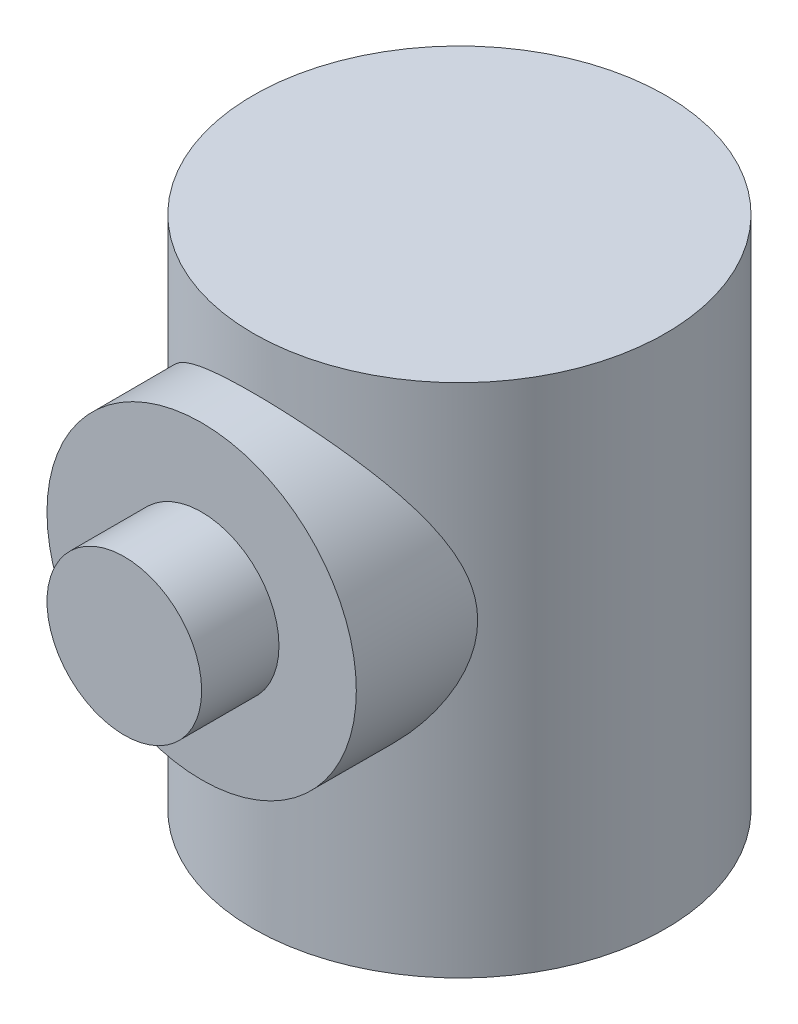
ISO-10303-21;
HEADER;
FILE_DESCRIPTION(('STEP AP214'),'2;1');
FILE_NAME('part.step','',(''),(''),'','','');
FILE_SCHEMA(('AUTOMOTIVE_DESIGN { 1 0 10303 214 1 1 1 1 }'));
ENDSEC;
DATA;
#1=APPLICATION_CONTEXT('core data for automotive mechanical design processes');
#2=APPLICATION_PROTOCOL_DEFINITION('international standard','automotive_design',2000,#1);
#3=PRODUCT_CONTEXT('',#1,'mechanical');
#4=PRODUCT('Part','Part','',(#3));
#5=PRODUCT_RELATED_PRODUCT_CATEGORY('part','',(#4));
#6=PRODUCT_DEFINITION_FORMATION('','',#4);
#7=PRODUCT_DEFINITION_CONTEXT('part definition',#1,'design');
#8=PRODUCT_DEFINITION('design','',#6,#7);
#9=PRODUCT_DEFINITION_SHAPE('','',#8);
#10=(LENGTH_UNIT() NAMED_UNIT(*) SI_UNIT(.MILLI.,.METRE.));
#11=(NAMED_UNIT(*) PLANE_ANGLE_UNIT() SI_UNIT($,.RADIAN.));
#12=(NAMED_UNIT(*) SI_UNIT($,.STERADIAN.) SOLID_ANGLE_UNIT());
#13=UNCERTAINTY_MEASURE_WITH_UNIT(LENGTH_MEASURE(1.E-05),#10,'distance_accuracy_value','');
#14=(GEOMETRIC_REPRESENTATION_CONTEXT(3) GLOBAL_UNCERTAINTY_ASSIGNED_CONTEXT((#13)) GLOBAL_UNIT_ASSIGNED_CONTEXT((#10,
#11,#12)) REPRESENTATION_CONTEXT('',''));
#15=CARTESIAN_POINT('',(0.,0.,0.));
#16=DIRECTION('',(0.,0.,1.));
#17=DIRECTION('',(1.,0.,0.));
#18=AXIS2_PLACEMENT_3D('',#15,#16,#17);
#19=CARTESIAN_POINT('',(0.,100.,0.));
#20=DIRECTION('',(0.,-1.,0.));
#21=DIRECTION('',(0.,0.,-1.));
#22=AXIS2_PLACEMENT_3D('',#19,#20,#21);
#23=CYLINDRICAL_SURFACE('',#22,40.);
#24=CARTESIAN_POINT('',(0.,100.,0.));
#25=DIRECTION('',(0.,1.,0.));
#26=DIRECTION('',(0.,0.,1.));
#27=AXIS2_PLACEMENT_3D('',#24,#25,#26);
#28=CIRCLE('',#27,40.);
#29=CARTESIAN_POINT('',(0.,100.,40.));
#30=VERTEX_POINT('',#29);
#31=EDGE_CURVE('E48',#30,#30,#28,.T.);
#32=ORIENTED_EDGE('',*,*,#31,.F.);
#33=EDGE_LOOP('',(#32));
#34=FACE_BOUND('',#33,.T.);
#35=CARTESIAN_POINT('',(0.,0.,0.));
#36=DIRECTION('',(0.,1.,0.));
#37=DIRECTION('',(0.,0.,1.));
#38=AXIS2_PLACEMENT_3D('',#35,#36,#37);
#39=CIRCLE('',#38,40.);
#40=CARTESIAN_POINT('',(0.,0.,40.));
#41=VERTEX_POINT('',#40);
#42=EDGE_CURVE('E61',#41,#41,#39,.T.);
#43=ORIENTED_EDGE('',*,*,#42,.T.);
#44=EDGE_LOOP('',(#43));
#45=FACE_BOUND('',#44,.T.);
#46=CARTESIAN_POINT('',(-30.,60.,26.4575131106459));
#47=CARTESIAN_POINT('',(-29.9999901359375,59.2998405138202,26.4575335088093));
#48=CARTESIAN_POINT('',(-29.975417377863,58.5995280577432,26.4854681873827));
#49=CARTESIAN_POINT('',(-29.877825638989,57.2065119199111,26.5955010971802));
#50=CARTESIAN_POINT('',(-29.8047904945962,56.5138108551583,26.6776173994755));
#51=CARTESIAN_POINT('',(-29.6120437956416,55.1411423293315,26.8914016541717));
#52=CARTESIAN_POINT('',(-29.4922219658747,54.4612089592852,27.0231866488994));
#53=CARTESIAN_POINT('',(-29.2085575718821,53.1203176334944,27.3295362041768));
#54=CARTESIAN_POINT('',(-29.04470224758,52.4593652396271,27.5041131637402));
#55=CARTESIAN_POINT('',(-28.7694227892252,51.4893430094092,27.7909610693061));
#56=CARTESIAN_POINT('',(-28.6735289054215,51.1717491195116,27.8899523672857));
#57=CARTESIAN_POINT('',(-28.4721003569898,50.5422711079854,28.0955551878497));
#58=CARTESIAN_POINT('',(-28.3665692816998,50.2303849120799,28.2021638701736));
#59=CARTESIAN_POINT('',(-28.0359007783745,49.3033248797493,28.5321777747143));
#60=CARTESIAN_POINT('',(-27.7966825802248,48.6967303508022,28.7657766453663));
#61=CARTESIAN_POINT('',(-27.2829694032794,47.5076411150634,29.2534610037519));
#62=CARTESIAN_POINT('',(-27.0084863018999,46.9251383809443,29.5075395831179));
#63=CARTESIAN_POINT('',(-26.4257606427246,45.7841809118825,30.0305260008613));
#64=CARTESIAN_POINT('',(-26.1175156360258,45.2257279254747,30.2994349142463));
#65=CARTESIAN_POINT('',(-25.4004799604089,44.0185589962804,30.9043557947668));
#66=CARTESIAN_POINT('',(-24.984153533674,43.3754416358282,31.242623996645));
#67=CARTESIAN_POINT('',(-24.1054102408405,42.1250695499427,31.9255224737044));
#68=CARTESIAN_POINT('',(-23.6429895833368,41.5178177811276,32.2701532703276));
#69=CARTESIAN_POINT('',(-22.6724021513159,40.3392341229466,32.9593223459287));
#70=CARTESIAN_POINT('',(-22.1641720478893,39.767953873029,33.3038598153625));
#71=CARTESIAN_POINT('',(-21.1032813402667,38.6636990669604,33.9860166693511));
#72=CARTESIAN_POINT('',(-20.5506170505432,38.1307276952406,34.3236354771273));
#73=CARTESIAN_POINT('',(-19.284053361477,37.0003089245736,35.0537196682181));
#74=CARTESIAN_POINT('',(-18.5602959930798,36.4119700343085,35.4432792377973));
#75=CARTESIAN_POINT('',(-17.0508645429086,35.2988464453328,36.193619391001));
#76=CARTESIAN_POINT('',(-16.265176602401,34.7740760389156,36.5543934965024));
#77=CARTESIAN_POINT('',(-15.0437008514415,34.0401785522885,37.0659114128811));
#78=CARTESIAN_POINT('',(-14.6297248243183,33.8045855947033,37.2313592282778));
#79=CARTESIAN_POINT('',(-13.7877079840592,33.3517817463831,37.5513226746533));
#80=CARTESIAN_POINT('',(-13.3596680306474,33.1345697349173,37.705838972059));
#81=CARTESIAN_POINT('',(-12.4904452810925,32.7195934734038,38.0026258245914));
#82=CARTESIAN_POINT('',(-12.0492701693727,32.5218181327485,38.1449033573359));
#83=CARTESIAN_POINT('',(-11.154274459431,32.1464954960194,38.4161540849943));
#84=CARTESIAN_POINT('',(-10.7004508798339,31.9689530200945,38.5451241089226));
#85=CARTESIAN_POINT('',(-9.59918752732703,31.5690059304673,38.8367859190684));
#86=CARTESIAN_POINT('',(-8.94622311190012,31.3566661906166,38.9926149778366));
#87=CARTESIAN_POINT('',(-7.62112152480346,30.9759852332847,39.273106074276));
#88=CARTESIAN_POINT('',(-6.94898896839565,30.807633522029,39.3977755450629));
#89=CARTESIAN_POINT('',(-5.92971733436566,30.5898109724029,39.5595361021982));
#90=CARTESIAN_POINT('',(-5.58817566784746,30.5229963223862,39.6092424924974));
#91=CARTESIAN_POINT('',(-4.90192697970607,30.4011393467206,39.700011358748));
#92=CARTESIAN_POINT('',(-4.55722055147484,30.346094859356,39.7410754219331));
#93=CARTESIAN_POINT('',(-3.5190716075999,30.1989198342497,39.8509726245697));
#94=CARTESIAN_POINT('',(-2.82153252466211,30.1247333951677,39.9065214536293));
#95=CARTESIAN_POINT('',(-1.41926068262208,30.0253236036456,39.9809974547584));
#96=CARTESIAN_POINT('',(-0.714513862683263,30.0002290659474,39.9998282801657));
#97=CARTESIAN_POINT('',(0.695026583026839,29.9997740986644,40.0001693463758));
#98=CARTESIAN_POINT('',(1.39982020860187,30.0244134722752,39.9816797348612));
#99=CARTESIAN_POINT('',(2.80411174163698,30.1230430873916,39.9077873827936));
#100=CARTESIAN_POINT('',(3.50360857462053,30.1970430842996,39.8523773454629));
#101=CARTESIAN_POINT('',(4.89199005587118,30.3932445478054,39.7058649908047));
#102=CARTESIAN_POINT('',(5.58087477453922,30.5154456944928,39.6147629103648));
#103=CARTESIAN_POINT('',(6.91989587910371,30.8012406639089,39.4025218273228));
#104=CARTESIAN_POINT('',(7.57055016040094,30.9632668436204,39.2825232649855));
#105=CARTESIAN_POINT('',(8.85393019602139,31.3285323091828,39.0133032203408));
#106=CARTESIAN_POINT('',(9.48665648945799,31.5317703542475,38.8640826178408));
#107=CARTESIAN_POINT('',(10.7312228369238,31.9771918114323,38.5390010130177));
#108=CARTESIAN_POINT('',(11.3430610147216,32.2193787109529,38.3631376252362));
#109=CARTESIAN_POINT('',(12.543403029849,32.7403012004326,37.9876111298209));
#110=CARTESIAN_POINT('',(13.1319054836893,33.0190389531507,37.7879466139086));
#111=CARTESIAN_POINT('',(14.3460603447195,33.6427355129009,37.3450407298944));
#112=CARTESIAN_POINT('',(14.9688405399538,33.9915963253123,37.0994218583113));
#113=CARTESIAN_POINT('',(16.1816063386835,34.7282938924704,36.5867346385137));
#114=CARTESIAN_POINT('',(16.7715899389559,35.1161330239672,36.3196649825112));
#115=CARTESIAN_POINT('',(17.9178781589128,35.9283687826077,35.7680649256376));
#116=CARTESIAN_POINT('',(18.4741592127737,36.3527904982657,35.4835225809954));
#117=CARTESIAN_POINT('',(19.5517306331156,37.2356624316913,34.901360039043));
#118=CARTESIAN_POINT('',(20.0730193379858,37.6941142632046,34.6037392218107));
#119=CARTESIAN_POINT('',(21.1790841946811,38.736601657358,33.940241156634));
#120=CARTESIAN_POINT('',(21.7561712877995,39.3275985676885,33.572455813191));
#121=CARTESIAN_POINT('',(22.8584575718091,40.5533923245376,32.831873049987));
#122=CARTESIAN_POINT('',(23.3836467266913,41.1881976025535,32.4590746765811));
#123=CARTESIAN_POINT('',(24.3812167081983,42.5004016906035,31.7166046816077));
#124=CARTESIAN_POINT('',(24.8535694603811,43.1778228485822,31.3469348178795));
#125=CARTESIAN_POINT('',(25.7434840551705,44.5741047188811,30.6202998772056));
#126=CARTESIAN_POINT('',(26.1610581378452,45.2929561219361,30.2633319750946));
#127=CARTESIAN_POINT('',(26.862339388971,46.6259740954275,29.6410062026542));
#128=CARTESIAN_POINT('',(27.1562097394482,47.2328484075858,29.3714594668941));
#129=CARTESIAN_POINT('',(27.7053336683826,48.4728918811556,28.8540594656093));
#130=CARTESIAN_POINT('',(27.9605876847612,49.1060607442748,28.6062059540901));
#131=CARTESIAN_POINT('',(28.4296981068429,50.3967279802008,28.1400332911125));
#132=CARTESIAN_POINT('',(28.6436305823115,51.054178940426,27.921660096263));
#133=CARTESIAN_POINT('',(29.0278173409555,52.392752019875,27.5220419299364));
#134=CARTESIAN_POINT('',(29.1980830126647,53.0738679144319,27.3407872802359));
#135=CARTESIAN_POINT('',(29.462735894409,54.3194713060816,27.0550779426188));
#136=CARTESIAN_POINT('',(29.5654729740914,54.8803300550064,26.94252215892));
#137=CARTESIAN_POINT('',(29.7393345058721,56.0125403309787,26.7504923753927));
#138=CARTESIAN_POINT('',(29.8104630046277,56.5838905051133,26.6710141409266));
#139=CARTESIAN_POINT('',(29.9197836662051,57.7330088338857,26.5483209969902));
#140=CARTESIAN_POINT('',(29.9580115660455,58.3107693325871,26.5050667419857));
#141=CARTESIAN_POINT('',(30.0009016159764,59.4691563374622,26.4565111263484));
#142=CARTESIAN_POINT('',(30.0055634208838,60.0497828730477,26.4512101560153));
#143=CARTESIAN_POINT('',(29.9812181252638,61.2095978404305,26.4788006103158));
#144=CARTESIAN_POINT('',(29.9521999426416,61.7887857359996,26.5117046059489));
#145=CARTESIAN_POINT('',(29.861068405942,62.9412173783637,26.6143053106113));
#146=CARTESIAN_POINT('',(29.7989550139452,63.5144611183473,26.6840020617966));
#147=CARTESIAN_POINT('',(29.64266807512,64.6521443811364,26.8575093508643));
#148=CARTESIAN_POINT('',(29.5484477291897,65.2165697871987,26.9613696778678));
#149=CARTESIAN_POINT('',(29.3294687201407,66.3329304025701,27.1994183018092));
#150=CARTESIAN_POINT('',(29.2047057408093,66.8848638344892,27.333610885024));
#151=CARTESIAN_POINT('',(28.87411521445,68.1781627775687,27.6832617572636));
#152=CARTESIAN_POINT('',(28.6554238308836,68.9131197013285,27.9103384791502));
#153=CARTESIAN_POINT('',(28.1673440954883,70.3527320998335,28.4028308959851));
#154=CARTESIAN_POINT('',(27.8979352594867,71.0573751894191,28.6682620717357));
#155=CARTESIAN_POINT('',(27.3113543177481,72.4359077959977,29.2276302231176));
#156=CARTESIAN_POINT('',(26.9941162293458,73.109753125979,29.5216063752655));
#157=CARTESIAN_POINT('',(26.3147035514882,74.4251289980795,30.1287895471437));
#158=CARTESIAN_POINT('',(25.9525330207061,75.0666624515279,30.4419948286494));
#159=CARTESIAN_POINT('',(25.1713862455929,76.3394763891441,31.0912904166771));
#160=CARTESIAN_POINT('',(24.7508499851084,76.9695846897664,31.4277984212647));
#161=CARTESIAN_POINT('',(23.864845381789,78.1945186544006,32.1057688012388));
#162=CARTESIAN_POINT('',(23.3993768653336,78.7893441820638,32.4472311957648));
#163=CARTESIAN_POINT('',(22.4242180385033,79.9430473030186,33.1286649107442));
#164=CARTESIAN_POINT('',(21.9145083601135,80.5019089636112,33.4686355089957));
#165=CARTESIAN_POINT('',(20.8517416367347,81.5819105066535,34.1408894208264));
#166=CARTESIAN_POINT('',(20.2986796794519,82.1030461014154,34.4731718577108));
#167=CARTESIAN_POINT('',(19.0243964670551,83.214979746186,35.1954471155079));
#168=CARTESIAN_POINT('',(18.2928385110214,83.7961152380999,35.5821837411025));
#169=CARTESIAN_POINT('',(16.768034852921,84.8940804765492,36.3256403034061));
#170=CARTESIAN_POINT('',(15.9747752141176,85.4108956259227,36.6823534205141));
#171=CARTESIAN_POINT('',(14.7421926400582,86.1322424112769,37.1868899008199));
#172=CARTESIAN_POINT('',(14.3245134325174,86.3635735986129,37.3498798290309));
#173=CARTESIAN_POINT('',(13.4752231499204,86.8076088779541,37.6646164097702));
#174=CARTESIAN_POINT('',(13.0436129213165,87.0203140987727,37.8163637435619));
#175=CARTESIAN_POINT('',(12.1674271811188,87.4260214717545,38.1073048786515));
#176=CARTESIAN_POINT('',(11.722859387092,87.6190350559988,38.2465059582068));
#177=CARTESIAN_POINT('',(10.821291381876,87.9845733352862,38.5113031958771));
#178=CARTESIAN_POINT('',(10.3642882510954,88.157093166855,38.6368961239552));
#179=CARTESIAN_POINT('',(9.25845168313938,88.5437404680318,38.9194230584803));
#180=CARTESIAN_POINT('',(8.60431029377182,88.7478570831221,39.0694791448423));
#181=CARTESIAN_POINT('',(7.27763404578468,89.1120067613629,39.3381980565156));
#182=CARTESIAN_POINT('',(6.60510361101053,89.2720503263455,39.4568683602391));
#183=CARTESIAN_POINT('',(5.58588255546192,89.4774164912333,39.6095446750676));
#184=CARTESIAN_POINT('',(5.24447084431566,89.5400800244905,39.6562087604605));
#185=CARTESIAN_POINT('',(4.55870005579571,89.6536514029317,39.7408808606396));
#186=CARTESIAN_POINT('',(4.21434153556854,89.7045614215327,39.778890475761));
#187=CARTESIAN_POINT('',(3.17756892977309,89.8393780664654,39.8796290782854));
#188=CARTESIAN_POINT('',(2.48139225086536,89.9053845252474,39.9290776942007));
#189=CARTESIAN_POINT('',(1.08292298969486,89.9886524101733,39.991480740485));
#190=CARTESIAN_POINT('',(0.38061984133231,90.0057982570242,40.0043486393563));
#191=CARTESIAN_POINT('',(-1.02317901582588,89.9907609585506,39.9930708046984));
#192=CARTESIAN_POINT('',(-1.72467472809418,89.9585780261811,39.9689252309584));
#193=CARTESIAN_POINT('',(-3.12162477813361,89.8453798799888,39.8841484815212));
#194=CARTESIAN_POINT('',(-3.81707771748429,89.7643536529036,39.8235090771431));
#195=CARTESIAN_POINT('',(-5.19673025531799,89.5547096052924,39.6670643629206));
#196=CARTESIAN_POINT('',(-5.88092988467813,89.4260919153716,39.5712591495819));
#197=CARTESIAN_POINT('',(-7.21378465972089,89.1275489124413,39.3497700146587));
#198=CARTESIAN_POINT('',(-7.86289450124931,88.9589375223046,39.2250388404375));
#199=CARTESIAN_POINT('',(-9.14263541411576,88.5807179536929,38.946643706994));
#200=CARTESIAN_POINT('',(-9.77326697281217,88.3711108575867,38.792980511639));
#201=CARTESIAN_POINT('',(-11.0131704920952,87.9132032767843,38.4593593722203));
#202=CARTESIAN_POINT('',(-11.6224406840502,87.6648995973971,38.2793992572268));
#203=CARTESIAN_POINT('',(-12.817258127468,87.1320083629251,37.896063472006));
#204=CARTESIAN_POINT('',(-13.4028039678962,86.847418653847,37.692686411783));
#205=CARTESIAN_POINT('',(-14.6132617772721,86.2101484969049,37.2413168322984));
#206=CARTESIAN_POINT('',(-15.2351239301416,85.8534068710429,36.9908800076675));
#207=CARTESIAN_POINT('',(-16.4454429401819,85.1009028857494,36.4689163627908));
#208=CARTESIAN_POINT('',(-17.0338976467188,84.7051380186405,36.1973881874291));
#209=CARTESIAN_POINT('',(-18.1766022590615,83.876964619781,35.6372879567252));
#210=CARTESIAN_POINT('',(-18.7308258464532,83.4445284850252,35.3487031129837));
#211=CARTESIAN_POINT('',(-19.8037445375399,82.5455452845105,34.7589775313594));
#212=CARTESIAN_POINT('',(-20.3224380013612,82.0789966463592,34.45783621497));
#213=CARTESIAN_POINT('',(-21.4227825659808,81.0180511231534,33.7869435376278));
#214=CARTESIAN_POINT('',(-21.9965837020438,80.4166231599772,33.415406479147));
#215=CARTESIAN_POINT('',(-23.0914377558525,79.1696158769392,32.668406372931));
#216=CARTESIAN_POINT('',(-23.6124798866271,78.5240275731949,32.2929425395809));
#217=CARTESIAN_POINT('',(-24.6007680358267,77.1898734312829,31.5465650147892));
#218=CARTESIAN_POINT('',(-25.067989961758,76.5012885568472,31.1756534270172));
#219=CARTESIAN_POINT('',(-25.9465535273874,75.0821937193567,30.4483382713417));
#220=CARTESIAN_POINT('',(-26.357909601213,74.3516946553722,30.0919309726785));
#221=CARTESIAN_POINT('',(-27.039605191112,73.011393602975,29.4791829289521));
#222=CARTESIAN_POINT('',(-27.3212143777373,72.4095908655871,29.2178529333623));
#223=CARTESIAN_POINT('',(-27.8467202104144,71.1806400209951,28.7174471290762));
#224=CARTESIAN_POINT('',(-28.0906167611356,70.5534918497275,28.4783713766352));
#225=CARTESIAN_POINT('',(-28.5378695047583,69.2761462097034,28.0301637613251));
#226=CARTESIAN_POINT('',(-28.7413147161507,68.6260031458888,27.8209664395758));
#227=CARTESIAN_POINT('',(-29.10553873582,67.3032638184189,27.439702626509));
#228=CARTESIAN_POINT('',(-29.2663324631703,66.6306754988196,27.2676231556742));
#229=CARTESIAN_POINT('',(-29.5018712469533,65.4664196933091,27.0122241725535));
#230=CARTESIAN_POINT('',(-29.5880241958298,64.9794935329782,26.9176714150947));
#231=CARTESIAN_POINT('',(-29.7365614795448,63.9978966492952,26.7534896908061));
#232=CARTESIAN_POINT('',(-29.7989499731954,63.5032272968018,26.6838563631711));
#233=CARTESIAN_POINT('',(-29.8991076457599,62.5085874582641,26.5715838891791));
#234=CARTESIAN_POINT('',(-29.9368894934874,62.0086198350201,26.5289308522552));
#235=CARTESIAN_POINT('',(-29.9873402105695,61.0057946018726,26.4718870145598));
#236=CARTESIAN_POINT('',(-30.0000070855281,60.5029367656352,26.4574984582895));
#237=CARTESIAN_POINT('',(-30.,60.,26.4575131106459));
#238=B_SPLINE_CURVE_WITH_KNOTS('',3,(#46,#47,#48,#49,#50,#51,#52,#53,#54,#55,#56,#57,#58,#59,
#60,#61,#62,#63,#64,#65,#66,#67,#68,#69,#70,#71,#72,#73,#74,#75,#76,#77,#78,#79,#80,#81,#82,#83,
#84,#85,#86,#87,#88,#89,#90,#91,#92,#93,#94,#95,#96,#97,#98,#99,#100,#101,#102,#103,#104,#105,
#106,#107,#108,#109,#110,#111,#112,#113,#114,#115,#116,#117,#118,#119,#120,#121,#122,#123,#124,
#125,#126,#127,#128,#129,#130,#131,#132,#133,#134,#135,#136,#137,#138,#139,#140,#141,#142,#143,
#144,#145,#146,#147,#148,#149,#150,#151,#152,#153,#154,#155,#156,#157,#158,#159,#160,#161,#162,
#163,#164,#165,#166,#167,#168,#169,#170,#171,#172,#173,#174,#175,#176,#177,#178,#179,#180,#181,
#182,#183,#184,#185,#186,#187,#188,#189,#190,#191,#192,#193,#194,#195,#196,#197,#198,#199,#200,
#201,#202,#203,#204,#205,#206,#207,#208,#209,#210,#211,#212,#213,#214,#215,#216,#217,#218,#219,
#220,#221,#222,#223,#224,#225,#226,#227,#228,#229,#230,#231,#232,#233,#234,#235,#236,#237),
.UNSPECIFIED.,.T.,.F.,(4,2,2,2,2,2,2,2,2,2,2,2,2,2,2,2,2,2,2,2,2,2,2,2,2,2,2,2,2,2,2,2,2,2,2,2,
2,2,2,2,2,2,2,2,2,2,2,2,2,2,2,2,2,2,2,2,2,2,2,2,2,2,2,2,2,2,2,2,2,2,2,2,2,2,2,2,2,2,2,2,2,2,2,2,
2,2,2,2,2,2,2,2,2,2,2,4),(0.,2.09978661723417,4.20027392567422,6.30574221555129,
8.41182128957935,9.45022909788225,10.4882517200632,12.5642346184581,14.6395201382585,
16.7149562876712,19.225167869535,21.7355860953597,24.2495296765227,26.7636819885379,
29.792058039948,32.8211137114655,34.3332825523532,35.8453591261136,37.3565678341895,
38.8681358137121,40.978107543847,43.0875754590624,44.1419387934211,45.1961083160728,
47.3042402838129,49.4178965060162,51.5315443641895,53.6456100776498,55.7596617603186,
57.8010271256667,59.8423310397285,61.8838178298163,63.925425471754,66.1879825262585,
68.4506776267163,70.7149370328361,72.9793038813167,75.6891982544116,78.3996156448107,
81.1114664329157,83.8227102332375,85.9995769124483,88.1764189034564,90.3492144823814,
92.5214428071025,94.2633046878555,96.0049435041708,97.7446881355925,99.4844506579715,
101.224785795785,102.965122927628,104.708007703541,106.451138922129,108.846621852329,
111.243074373283,113.642863684766,116.042436384856,118.527181470435,121.011936157583,
123.497784167436,125.98391425974,129.013320686851,132.043413372909,133.556412577467,
135.069320024239,136.581344086002,138.093726259873,140.195897895347,142.297568186038,
143.348002121398,144.398241658491,146.498518611987,148.603759642318,150.708991584243,
152.814698394806,154.920399426715,156.964696998135,159.008940603286,161.053353065444,
163.097886943552,165.373922084112,167.650103580694,169.928013864598,172.206029213483,
174.934783091596,177.664093761953,180.394621492801,183.124442386258,185.264794933933,
187.405152891944,189.540747271333,191.675593652595,193.184828979993,194.69380006766,
196.201993641079,197.710306976314),.UNSPECIFIED.);
#239=CARTESIAN_POINT('',(-30.,60.,26.4575131106459));
#240=VERTEX_POINT('',#239);
#241=EDGE_CURVE('E36',#240,#240,#238,.T.);
#242=ORIENTED_EDGE('',*,*,#241,.F.);
#243=EDGE_LOOP('',(#242));
#244=FACE_BOUND('',#243,.T.);
#245=ADVANCED_FACE('F32',(#34,#45,#244),#23,.T.);
#246=CARTESIAN_POINT('',(0.,100.,0.));
#247=DIRECTION('',(0.,1.,0.));
#248=DIRECTION('',(0.,0.,1.));
#249=AXIS2_PLACEMENT_3D('',#246,#247,#248);
#250=PLANE('',#249);
#251=ORIENTED_EDGE('',*,*,#31,.T.);
#252=EDGE_LOOP('',(#251));
#253=FACE_BOUND('',#252,.T.);
#254=ADVANCED_FACE('F71',(#253),#250,.T.);
#255=CARTESIAN_POINT('',(0.,0.,0.));
#256=DIRECTION('',(0.,1.,0.));
#257=DIRECTION('',(0.,0.,1.));
#258=AXIS2_PLACEMENT_3D('',#255,#256,#257);
#259=PLANE('',#258);
#260=CARTESIAN_POINT('',(0.,0.,0.));
#261=DIRECTION('',(0.,1.,0.));
#262=DIRECTION('',(0.,0.,1.));
#263=AXIS2_PLACEMENT_3D('',#260,#261,#262);
#264=CIRCLE('',#263,15.);
#265=CARTESIAN_POINT('',(0.,0.,15.));
#266=VERTEX_POINT('',#265);
#267=EDGE_CURVE('E56',#266,#266,#264,.T.);
#268=ORIENTED_EDGE('',*,*,#267,.T.);
#269=EDGE_LOOP('',(#268));
#270=FACE_BOUND('',#269,.T.);
#271=ORIENTED_EDGE('',*,*,#42,.F.);
#272=EDGE_LOOP('',(#271));
#273=FACE_BOUND('',#272,.T.);
#274=ADVANCED_FACE('F68',(#270,#273),#259,.F.);
#275=CARTESIAN_POINT('',(0.,60.,50.));
#276=DIRECTION('',(0.,0.,-1.));
#277=DIRECTION('',(-1.,0.,0.));
#278=AXIS2_PLACEMENT_3D('',#275,#276,#277);
#279=CYLINDRICAL_SURFACE('',#278,30.);
#280=CARTESIAN_POINT('',(0.,60.,50.));
#281=DIRECTION('',(0.,0.,1.));
#282=DIRECTION('',(1.,0.,0.));
#283=AXIS2_PLACEMENT_3D('',#280,#281,#282);
#284=CIRCLE('',#283,30.);
#285=CARTESIAN_POINT('',(30.,60.,50.));
#286=VERTEX_POINT('',#285);
#287=EDGE_CURVE('E55',#286,#286,#284,.T.);
#288=ORIENTED_EDGE('',*,*,#287,.F.);
#289=EDGE_LOOP('',(#288));
#290=FACE_BOUND('',#289,.T.);
#291=ORIENTED_EDGE('',*,*,#241,.T.);
#292=EDGE_LOOP('',(#291));
#293=FACE_BOUND('',#292,.T.);
#294=ADVANCED_FACE('F70',(#290,#293),#279,.T.);
#295=CARTESIAN_POINT('',(0.,0.,50.));
#296=DIRECTION('',(0.,0.,1.));
#297=DIRECTION('',(1.,0.,0.));
#298=AXIS2_PLACEMENT_3D('',#295,#296,#297);
#299=PLANE('',#298);
#300=CARTESIAN_POINT('',(0.,60.,50.));
#301=DIRECTION('',(0.,0.,1.));
#302=DIRECTION('',(1.,0.,0.));
#303=AXIS2_PLACEMENT_3D('',#300,#301,#302);
#304=CIRCLE('',#303,15.);
#305=CARTESIAN_POINT('',(15.,60.,50.));
#306=VERTEX_POINT('',#305);
#307=EDGE_CURVE('E10',#306,#306,#304,.T.);
#308=ORIENTED_EDGE('',*,*,#307,.F.);
#309=EDGE_LOOP('',(#308));
#310=FACE_BOUND('',#309,.T.);
#311=ORIENTED_EDGE('',*,*,#287,.T.);
#312=EDGE_LOOP('',(#311));
#313=FACE_BOUND('',#312,.T.);
#314=ADVANCED_FACE('F77',(#310,#313),#299,.T.);
#315=CARTESIAN_POINT('',(0.,15.,0.));
#316=DIRECTION('',(0.,-1.,0.));
#317=DIRECTION('',(0.,0.,-1.));
#318=AXIS2_PLACEMENT_3D('',#315,#316,#317);
#319=CYLINDRICAL_SURFACE('',#318,15.);
#320=CARTESIAN_POINT('',(0.,15.,0.));
#321=DIRECTION('',(0.,1.,0.));
#322=DIRECTION('',(0.,0.,1.));
#323=AXIS2_PLACEMENT_3D('',#320,#321,#322);
#324=CIRCLE('',#323,15.);
#325=CARTESIAN_POINT('',(0.,15.,15.));
#326=VERTEX_POINT('',#325);
#327=EDGE_CURVE('E52',#326,#326,#324,.T.);
#328=ORIENTED_EDGE('',*,*,#327,.T.);
#329=EDGE_LOOP('',(#328));
#330=FACE_BOUND('',#329,.T.);
#331=ORIENTED_EDGE('',*,*,#267,.F.);
#332=EDGE_LOOP('',(#331));
#333=FACE_BOUND('',#332,.T.);
#334=ADVANCED_FACE('F112',(#330,#333),#319,.F.);
#335=CARTESIAN_POINT('',(0.,15.,0.));
#336=DIRECTION('',(0.,1.,0.));
#337=DIRECTION('',(0.,0.,1.));
#338=AXIS2_PLACEMENT_3D('',#335,#336,#337);
#339=PLANE('',#338);
#340=ORIENTED_EDGE('',*,*,#327,.F.);
#341=EDGE_LOOP('',(#340));
#342=FACE_BOUND('',#341,.T.);
#343=ADVANCED_FACE('F122',(#342),#339,.F.);
#344=CARTESIAN_POINT('',(0.,60.,65.));
#345=DIRECTION('',(0.,0.,-1.));
#346=DIRECTION('',(-1.,0.,0.));
#347=AXIS2_PLACEMENT_3D('',#344,#345,#346);
#348=CYLINDRICAL_SURFACE('',#347,15.);
#349=CARTESIAN_POINT('',(0.,60.,65.));
#350=DIRECTION('',(0.,0.,1.));
#351=DIRECTION('',(1.,0.,0.));
#352=AXIS2_PLACEMENT_3D('',#349,#350,#351);
#353=CIRCLE('',#352,15.);
#354=CARTESIAN_POINT('',(15.,60.,65.));
#355=VERTEX_POINT('',#354);
#356=EDGE_CURVE('E51',#355,#355,#353,.T.);
#357=ORIENTED_EDGE('',*,*,#356,.F.);
#358=EDGE_LOOP('',(#357));
#359=FACE_BOUND('',#358,.T.);
#360=ORIENTED_EDGE('',*,*,#307,.T.);
#361=EDGE_LOOP('',(#360));
#362=FACE_BOUND('',#361,.T.);
#363=ADVANCED_FACE('F130',(#359,#362),#348,.T.);
#364=CARTESIAN_POINT('',(0.,60.,65.));
#365=DIRECTION('',(0.,0.,1.));
#366=DIRECTION('',(1.,0.,0.));
#367=AXIS2_PLACEMENT_3D('',#364,#365,#366);
#368=PLANE('',#367);
#369=ORIENTED_EDGE('',*,*,#356,.T.);
#370=EDGE_LOOP('',(#369));
#371=FACE_BOUND('',#370,.T.);
#372=ADVANCED_FACE('F138',(#371),#368,.T.);
#373=CLOSED_SHELL('',(#245,#254,#274,#294,#314,#334,#343,#363,#372));
#374=MANIFOLD_SOLID_BREP('B2',#373);
#375=ADVANCED_BREP_SHAPE_REPRESENTATION('',(#18,#374),#14);
#376=SHAPE_DEFINITION_REPRESENTATION(#9,#375);
ENDSEC;
END-ISO-10303-21;
